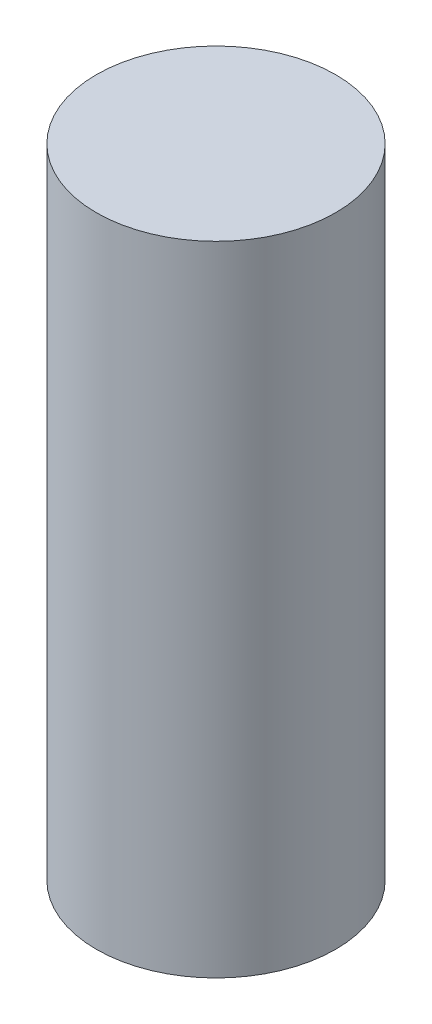
ISO-10303-21;
HEADER;
FILE_DESCRIPTION(('STEP AP214'),'2;1');
FILE_NAME('part.step','',(''),(''),'','','');
FILE_SCHEMA(('AUTOMOTIVE_DESIGN { 1 0 10303 214 1 1 1 1 }'));
ENDSEC;
DATA;
#1=APPLICATION_CONTEXT('core data for automotive mechanical design processes');
#2=APPLICATION_PROTOCOL_DEFINITION('international standard','automotive_design',2000,#1);
#3=PRODUCT_CONTEXT('',#1,'mechanical');
#4=PRODUCT('Part','Part','',(#3));
#5=PRODUCT_RELATED_PRODUCT_CATEGORY('part','',(#4));
#6=PRODUCT_DEFINITION_FORMATION('','',#4);
#7=PRODUCT_DEFINITION_CONTEXT('part definition',#1,'design');
#8=PRODUCT_DEFINITION('design','',#6,#7);
#9=PRODUCT_DEFINITION_SHAPE('','',#8);
#10=(LENGTH_UNIT() NAMED_UNIT(*) SI_UNIT(.MILLI.,.METRE.));
#11=(NAMED_UNIT(*) PLANE_ANGLE_UNIT() SI_UNIT($,.RADIAN.));
#12=(NAMED_UNIT(*) SI_UNIT($,.STERADIAN.) SOLID_ANGLE_UNIT());
#13=UNCERTAINTY_MEASURE_WITH_UNIT(LENGTH_MEASURE(1.E-05),#10,'distance_accuracy_value','');
#14=(GEOMETRIC_REPRESENTATION_CONTEXT(3) GLOBAL_UNCERTAINTY_ASSIGNED_CONTEXT((#13)) GLOBAL_UNIT_ASSIGNED_CONTEXT((#10,
#11,#12)) REPRESENTATION_CONTEXT('',''));
#15=CARTESIAN_POINT('',(0.,0.,0.));
#16=DIRECTION('',(0.,0.,1.));
#17=DIRECTION('',(1.,0.,0.));
#18=AXIS2_PLACEMENT_3D('',#15,#16,#17);
#19=CARTESIAN_POINT('',(0.,32.,0.));
#20=DIRECTION('',(0.,-1.,0.));
#21=DIRECTION('',(0.,0.,-1.));
#22=AXIS2_PLACEMENT_3D('',#19,#20,#21);
#23=CYLINDRICAL_SURFACE('',#22,6.);
#24=CARTESIAN_POINT('',(0.,32.,0.));
#25=DIRECTION('',(0.,1.,0.));
#26=DIRECTION('',(0.,0.,1.));
#27=AXIS2_PLACEMENT_3D('',#24,#25,#26);
#28=CIRCLE('',#27,6.);
#29=CARTESIAN_POINT('',(0.,32.,6.));
#30=VERTEX_POINT('',#29);
#31=EDGE_CURVE('E10',#30,#30,#28,.T.);
#32=ORIENTED_EDGE('',*,*,#31,.F.);
#33=EDGE_LOOP('',(#32));
#34=FACE_BOUND('',#33,.T.);
#35=CARTESIAN_POINT('',(0.,0.,0.));
#36=DIRECTION('',(0.,1.,0.));
#37=DIRECTION('',(0.,0.,1.));
#38=AXIS2_PLACEMENT_3D('',#35,#36,#37);
#39=CIRCLE('',#38,6.);
#40=CARTESIAN_POINT('',(0.,0.,6.));
#41=VERTEX_POINT('',#40);
#42=EDGE_CURVE('E33',#41,#41,#39,.T.);
#43=ORIENTED_EDGE('',*,*,#42,.T.);
#44=EDGE_LOOP('',(#43));
#45=FACE_BOUND('',#44,.T.);
#46=ADVANCED_FACE('F30',(#34,#45),#23,.T.);
#47=CARTESIAN_POINT('',(0.,32.,0.));
#48=DIRECTION('',(0.,1.,0.));
#49=DIRECTION('',(0.,0.,1.));
#50=AXIS2_PLACEMENT_3D('',#47,#48,#49);
#51=PLANE('',#50);
#52=ORIENTED_EDGE('',*,*,#31,.T.);
#53=EDGE_LOOP('',(#52));
#54=FACE_BOUND('',#53,.T.);
#55=ADVANCED_FACE('F45',(#54),#51,.T.);
#56=CARTESIAN_POINT('',(0.,0.,0.));
#57=DIRECTION('',(0.,1.,0.));
#58=DIRECTION('',(0.,0.,1.));
#59=AXIS2_PLACEMENT_3D('',#56,#57,#58);
#60=PLANE('',#59);
#61=ORIENTED_EDGE('',*,*,#42,.F.);
#62=EDGE_LOOP('',(#61));
#63=FACE_BOUND('',#62,.T.);
#64=ADVANCED_FACE('F43',(#63),#60,.F.);
#65=CLOSED_SHELL('',(#46,#55,#64));
#66=MANIFOLD_SOLID_BREP('B2',#65);
#67=ADVANCED_BREP_SHAPE_REPRESENTATION('',(#18,#66),#14);
#68=SHAPE_DEFINITION_REPRESENTATION(#9,#67);
ENDSEC;
END-ISO-10303-21;
